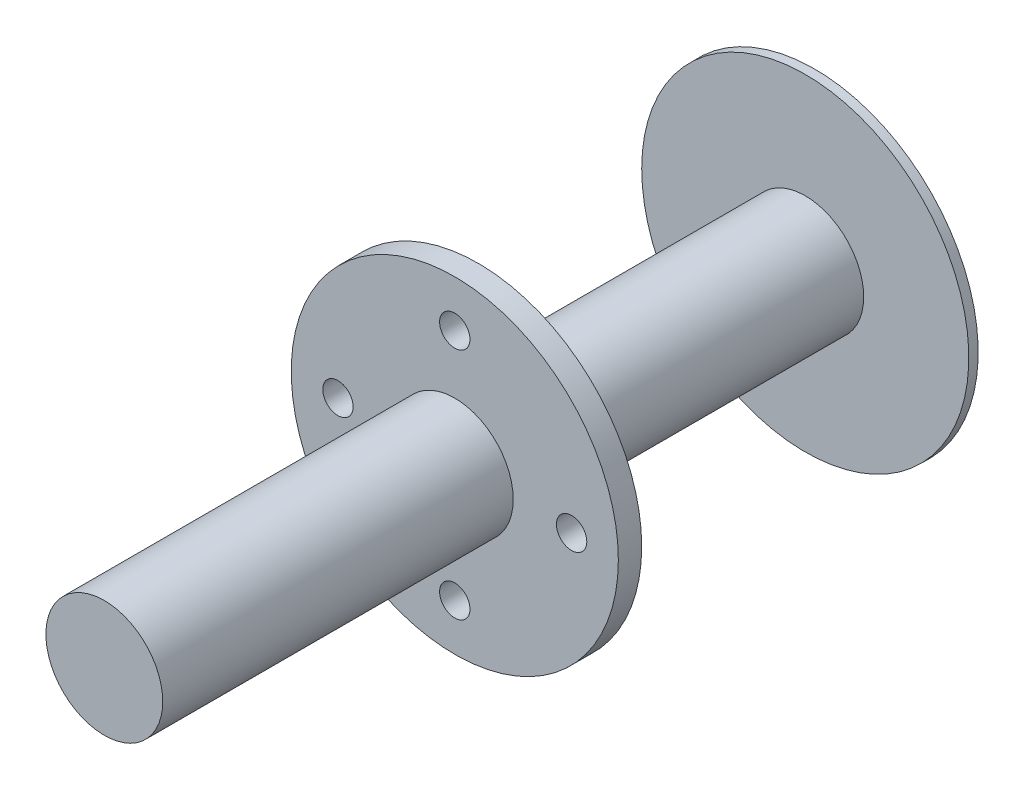
ISO-10303-21;
HEADER;
FILE_DESCRIPTION(('STEP AP214'),'2;1');
FILE_NAME('part.step','',(''),(''),'','','');
FILE_SCHEMA(('AUTOMOTIVE_DESIGN { 1 0 10303 214 1 1 1 1 }'));
ENDSEC;
DATA;
#1=APPLICATION_CONTEXT('core data for automotive mechanical design processes');
#2=APPLICATION_PROTOCOL_DEFINITION('international standard','automotive_design',2000,#1);
#3=PRODUCT_CONTEXT('',#1,'mechanical');
#4=PRODUCT('Part','Part','',(#3));
#5=PRODUCT_RELATED_PRODUCT_CATEGORY('part','',(#4));
#6=PRODUCT_DEFINITION_FORMATION('','',#4);
#7=PRODUCT_DEFINITION_CONTEXT('part definition',#1,'design');
#8=PRODUCT_DEFINITION('design','',#6,#7);
#9=PRODUCT_DEFINITION_SHAPE('','',#8);
#10=(LENGTH_UNIT() NAMED_UNIT(*) SI_UNIT(.MILLI.,.METRE.));
#11=(NAMED_UNIT(*) PLANE_ANGLE_UNIT() SI_UNIT($,.RADIAN.));
#12=(NAMED_UNIT(*) SI_UNIT($,.STERADIAN.) SOLID_ANGLE_UNIT());
#13=UNCERTAINTY_MEASURE_WITH_UNIT(LENGTH_MEASURE(1.E-05),#10,'distance_accuracy_value','');
#14=(GEOMETRIC_REPRESENTATION_CONTEXT(3) GLOBAL_UNCERTAINTY_ASSIGNED_CONTEXT((#13)) GLOBAL_UNIT_ASSIGNED_CONTEXT((#10,
#11,#12)) REPRESENTATION_CONTEXT('',''));
#15=CARTESIAN_POINT('',(0.,0.,0.));
#16=DIRECTION('',(0.,0.,1.));
#17=DIRECTION('',(1.,0.,0.));
#18=AXIS2_PLACEMENT_3D('',#15,#16,#17);
#19=CARTESIAN_POINT('',(0.,0.,10.));
#20=DIRECTION('',(0.,0.,1.));
#21=DIRECTION('',(1.,0.,0.));
#22=AXIS2_PLACEMENT_3D('',#19,#20,#21);
#23=PLANE('',#22);
#24=CARTESIAN_POINT('',(0.,0.,10.));
#25=DIRECTION('',(0.,0.,1.));
#26=DIRECTION('',(1.,0.,0.));
#27=AXIS2_PLACEMENT_3D('',#24,#25,#26);
#28=CIRCLE('',#27,25.);
#29=CARTESIAN_POINT('',(25.,0.,10.));
#30=VERTEX_POINT('',#29);
#31=EDGE_CURVE('E10',#30,#30,#28,.T.);
#32=ORIENTED_EDGE('',*,*,#31,.F.);
#33=EDGE_LOOP('',(#32));
#34=FACE_BOUND('',#33,.T.);
#35=CARTESIAN_POINT('',(0.,-50.,10.));
#36=DIRECTION('',(0.,0.,1.));
#37=DIRECTION('',(1.,0.,0.));
#38=AXIS2_PLACEMENT_3D('',#35,#36,#37);
#39=CIRCLE('',#38,6.5);
#40=CARTESIAN_POINT('',(6.50000000000001,-50.,10.));
#41=VERTEX_POINT('',#40);
#42=EDGE_CURVE('E69',#41,#41,#39,.T.);
#43=ORIENTED_EDGE('',*,*,#42,.F.);
#44=EDGE_LOOP('',(#43));
#45=FACE_BOUND('',#44,.T.);
#46=CARTESIAN_POINT('',(0.,50.,10.));
#47=DIRECTION('',(0.,0.,1.));
#48=DIRECTION('',(1.,0.,0.));
#49=AXIS2_PLACEMENT_3D('',#46,#47,#48);
#50=CIRCLE('',#49,6.5);
#51=CARTESIAN_POINT('',(6.5,50.,10.));
#52=VERTEX_POINT('',#51);
#53=EDGE_CURVE('E85',#52,#52,#50,.T.);
#54=ORIENTED_EDGE('',*,*,#53,.F.);
#55=EDGE_LOOP('',(#54));
#56=FACE_BOUND('',#55,.T.);
#57=CARTESIAN_POINT('',(0.,0.,10.));
#58=DIRECTION('',(0.,0.,1.));
#59=DIRECTION('',(1.,0.,0.));
#60=AXIS2_PLACEMENT_3D('',#57,#58,#59);
#61=CIRCLE('',#60,70.);
#62=CARTESIAN_POINT('',(70.,0.,10.));
#63=VERTEX_POINT('',#62);
#64=EDGE_CURVE('E48',#63,#63,#61,.T.);
#65=ORIENTED_EDGE('',*,*,#64,.T.);
#66=EDGE_LOOP('',(#65));
#67=FACE_BOUND('',#66,.T.);
#68=CARTESIAN_POINT('',(50.,0.,10.));
#69=DIRECTION('',(0.,0.,1.));
#70=DIRECTION('',(1.,0.,0.));
#71=AXIS2_PLACEMENT_3D('',#68,#69,#70);
#72=CIRCLE('',#71,6.49999999999999);
#73=CARTESIAN_POINT('',(56.5,0.,10.));
#74=VERTEX_POINT('',#73);
#75=EDGE_CURVE('E77',#74,#74,#72,.T.);
#76=ORIENTED_EDGE('',*,*,#75,.F.);
#77=EDGE_LOOP('',(#76));
#78=FACE_BOUND('',#77,.T.);
#79=CARTESIAN_POINT('',(-50.,0.,10.));
#80=DIRECTION('',(0.,0.,1.));
#81=DIRECTION('',(1.,0.,0.));
#82=AXIS2_PLACEMENT_3D('',#79,#80,#81);
#83=CIRCLE('',#82,6.5);
#84=CARTESIAN_POINT('',(-43.5,0.,10.));
#85=VERTEX_POINT('',#84);
#86=EDGE_CURVE('E60',#85,#85,#83,.T.);
#87=ORIENTED_EDGE('',*,*,#86,.F.);
#88=EDGE_LOOP('',(#87));
#89=FACE_BOUND('',#88,.T.);
#90=ADVANCED_FACE('F39',(#34,#45,#56,#67,#78,#89),#23,.T.);
#91=CARTESIAN_POINT('',(0.,0.,0.));
#92=DIRECTION('',(0.,0.,1.));
#93=DIRECTION('',(1.,0.,0.));
#94=AXIS2_PLACEMENT_3D('',#91,#92,#93);
#95=PLANE('',#94);
#96=CARTESIAN_POINT('',(0.,0.,0.));
#97=DIRECTION('',(0.,0.,1.));
#98=DIRECTION('',(1.,0.,0.));
#99=AXIS2_PLACEMENT_3D('',#96,#97,#98);
#100=CIRCLE('',#99,25.);
#101=CARTESIAN_POINT('',(25.,0.,0.));
#102=VERTEX_POINT('',#101);
#103=EDGE_CURVE('E43',#102,#102,#100,.T.);
#104=ORIENTED_EDGE('',*,*,#103,.T.);
#105=EDGE_LOOP('',(#104));
#106=FACE_BOUND('',#105,.T.);
#107=CARTESIAN_POINT('',(0.,0.,0.));
#108=DIRECTION('',(0.,0.,1.));
#109=DIRECTION('',(1.,0.,0.));
#110=AXIS2_PLACEMENT_3D('',#107,#108,#109);
#111=CIRCLE('',#110,70.);
#112=CARTESIAN_POINT('',(70.,0.,0.));
#113=VERTEX_POINT('',#112);
#114=EDGE_CURVE('E54',#113,#113,#111,.T.);
#115=ORIENTED_EDGE('',*,*,#114,.F.);
#116=EDGE_LOOP('',(#115));
#117=FACE_BOUND('',#116,.T.);
#118=CARTESIAN_POINT('',(0.,50.,0.));
#119=DIRECTION('',(0.,0.,1.));
#120=DIRECTION('',(1.,0.,0.));
#121=AXIS2_PLACEMENT_3D('',#118,#119,#120);
#122=CIRCLE('',#121,6.5);
#123=CARTESIAN_POINT('',(6.5,50.,0.));
#124=VERTEX_POINT('',#123);
#125=EDGE_CURVE('E81',#124,#124,#122,.T.);
#126=ORIENTED_EDGE('',*,*,#125,.T.);
#127=EDGE_LOOP('',(#126));
#128=FACE_BOUND('',#127,.T.);
#129=CARTESIAN_POINT('',(50.,0.,0.));
#130=DIRECTION('',(0.,0.,1.));
#131=DIRECTION('',(1.,0.,0.));
#132=AXIS2_PLACEMENT_3D('',#129,#130,#131);
#133=CIRCLE('',#132,6.49999999999999);
#134=CARTESIAN_POINT('',(56.5,0.,0.));
#135=VERTEX_POINT('',#134);
#136=EDGE_CURVE('E73',#135,#135,#133,.T.);
#137=ORIENTED_EDGE('',*,*,#136,.T.);
#138=EDGE_LOOP('',(#137));
#139=FACE_BOUND('',#138,.T.);
#140=CARTESIAN_POINT('',(0.,-50.,0.));
#141=DIRECTION('',(0.,0.,1.));
#142=DIRECTION('',(1.,0.,0.));
#143=AXIS2_PLACEMENT_3D('',#140,#141,#142);
#144=CIRCLE('',#143,6.5);
#145=CARTESIAN_POINT('',(6.50000000000001,-50.,0.));
#146=VERTEX_POINT('',#145);
#147=EDGE_CURVE('E64',#146,#146,#144,.T.);
#148=ORIENTED_EDGE('',*,*,#147,.T.);
#149=EDGE_LOOP('',(#148));
#150=FACE_BOUND('',#149,.T.);
#151=CARTESIAN_POINT('',(-50.,0.,0.));
#152=DIRECTION('',(0.,0.,1.));
#153=DIRECTION('',(1.,0.,0.));
#154=AXIS2_PLACEMENT_3D('',#151,#152,#153);
#155=CIRCLE('',#154,6.5);
#156=CARTESIAN_POINT('',(-43.5,0.,0.));
#157=VERTEX_POINT('',#156);
#158=EDGE_CURVE('E65',#157,#157,#155,.T.);
#159=ORIENTED_EDGE('',*,*,#158,.T.);
#160=EDGE_LOOP('',(#159));
#161=FACE_BOUND('',#160,.T.);
#162=ADVANCED_FACE('F96',(#106,#117,#128,#139,#150,#161),#95,.F.);
#163=CARTESIAN_POINT('',(0.,0.,10.));
#164=DIRECTION('',(0.,0.,-1.));
#165=DIRECTION('',(-1.,0.,0.));
#166=AXIS2_PLACEMENT_3D('',#163,#164,#165);
#167=CYLINDRICAL_SURFACE('',#166,70.);
#168=ORIENTED_EDGE('',*,*,#64,.F.);
#169=EDGE_LOOP('',(#168));
#170=FACE_BOUND('',#169,.T.);
#171=ORIENTED_EDGE('',*,*,#114,.T.);
#172=EDGE_LOOP('',(#171));
#173=FACE_BOUND('',#172,.T.);
#174=ADVANCED_FACE('F41',(#170,#173),#167,.T.);
#175=CARTESIAN_POINT('',(0.,50.,10.));
#176=DIRECTION('',(0.,0.,-1.));
#177=DIRECTION('',(-1.,0.,0.));
#178=AXIS2_PLACEMENT_3D('',#175,#176,#177);
#179=CYLINDRICAL_SURFACE('',#178,6.5);
#180=ORIENTED_EDGE('',*,*,#53,.T.);
#181=EDGE_LOOP('',(#180));
#182=FACE_BOUND('',#181,.T.);
#183=ORIENTED_EDGE('',*,*,#125,.F.);
#184=EDGE_LOOP('',(#183));
#185=FACE_BOUND('',#184,.T.);
#186=ADVANCED_FACE('F131',(#182,#185),#179,.F.);
#187=CARTESIAN_POINT('',(50.,0.,10.));
#188=DIRECTION('',(0.,0.,-1.));
#189=DIRECTION('',(-1.,0.,0.));
#190=AXIS2_PLACEMENT_3D('',#187,#188,#189);
#191=CYLINDRICAL_SURFACE('',#190,6.49999999999999);
#192=ORIENTED_EDGE('',*,*,#75,.T.);
#193=EDGE_LOOP('',(#192));
#194=FACE_BOUND('',#193,.T.);
#195=ORIENTED_EDGE('',*,*,#136,.F.);
#196=EDGE_LOOP('',(#195));
#197=FACE_BOUND('',#196,.T.);
#198=ADVANCED_FACE('F121',(#194,#197),#191,.F.);
#199=CARTESIAN_POINT('',(0.,-50.,10.));
#200=DIRECTION('',(0.,0.,-1.));
#201=DIRECTION('',(-1.,0.,0.));
#202=AXIS2_PLACEMENT_3D('',#199,#200,#201);
#203=CYLINDRICAL_SURFACE('',#202,6.5);
#204=ORIENTED_EDGE('',*,*,#42,.T.);
#205=EDGE_LOOP('',(#204));
#206=FACE_BOUND('',#205,.T.);
#207=ORIENTED_EDGE('',*,*,#147,.F.);
#208=EDGE_LOOP('',(#207));
#209=FACE_BOUND('',#208,.T.);
#210=ADVANCED_FACE('F111',(#206,#209),#203,.F.);
#211=CARTESIAN_POINT('',(-50.,0.,10.));
#212=DIRECTION('',(0.,0.,-1.));
#213=DIRECTION('',(-1.,0.,0.));
#214=AXIS2_PLACEMENT_3D('',#211,#212,#213);
#215=CYLINDRICAL_SURFACE('',#214,6.5);
#216=ORIENTED_EDGE('',*,*,#86,.T.);
#217=EDGE_LOOP('',(#216));
#218=FACE_BOUND('',#217,.T.);
#219=ORIENTED_EDGE('',*,*,#158,.F.);
#220=EDGE_LOOP('',(#219));
#221=FACE_BOUND('',#220,.T.);
#222=ADVANCED_FACE('F108',(#218,#221),#215,.F.);
#223=CARTESIAN_POINT('',(0.,0.,-140.));
#224=DIRECTION('',(0.,0.,1.));
#225=DIRECTION('',(1.,0.,0.));
#226=AXIS2_PLACEMENT_3D('',#223,#224,#225);
#227=CYLINDRICAL_SURFACE('',#226,25.);
#228=CARTESIAN_POINT('',(0.,0.,-140.));
#229=DIRECTION('',(0.,0.,1.));
#230=DIRECTION('',(1.,0.,0.));
#231=AXIS2_PLACEMENT_3D('',#228,#229,#230);
#232=CIRCLE('',#231,25.);
#233=CARTESIAN_POINT('',(25.,0.,-140.));
#234=VERTEX_POINT('',#233);
#235=EDGE_CURVE('E58',#234,#234,#232,.T.);
#236=ORIENTED_EDGE('',*,*,#235,.T.);
#237=EDGE_LOOP('',(#236));
#238=FACE_BOUND('',#237,.T.);
#239=ORIENTED_EDGE('',*,*,#103,.F.);
#240=EDGE_LOOP('',(#239));
#241=FACE_BOUND('',#240,.T.);
#242=ADVANCED_FACE('F110',(#238,#241),#227,.T.);
#243=ORIENTED_EDGE('',*,*,#31,.T.);
#244=EDGE_LOOP('',(#243));
#245=FACE_BOUND('',#244,.T.);
#246=CARTESIAN_POINT('',(0.,0.,160.));
#247=DIRECTION('',(0.,0.,1.));
#248=DIRECTION('',(1.,0.,0.));
#249=AXIS2_PLACEMENT_3D('',#246,#247,#248);
#250=CIRCLE('',#249,25.);
#251=CARTESIAN_POINT('',(25.,0.,160.));
#252=VERTEX_POINT('',#251);
#253=EDGE_CURVE('E236',#252,#252,#250,.T.);
#254=ORIENTED_EDGE('',*,*,#253,.F.);
#255=EDGE_LOOP('',(#254));
#256=FACE_BOUND('',#255,.T.);
#257=ADVANCED_FACE('F118',(#245,#256),#227,.T.);
#258=CARTESIAN_POINT('',(0.,0.,160.));
#259=DIRECTION('',(0.,0.,1.));
#260=DIRECTION('',(1.,0.,0.));
#261=AXIS2_PLACEMENT_3D('',#258,#259,#260);
#262=PLANE('',#261);
#263=ORIENTED_EDGE('',*,*,#253,.T.);
#264=EDGE_LOOP('',(#263));
#265=FACE_BOUND('',#264,.T.);
#266=ADVANCED_FACE('F181',(#265),#262,.T.);
#267=CARTESIAN_POINT('',(0.,0.,-144.));
#268=DIRECTION('',(0.,0.,1.));
#269=DIRECTION('',(1.,0.,0.));
#270=AXIS2_PLACEMENT_3D('',#267,#268,#269);
#271=CYLINDRICAL_SURFACE('',#270,70.);
#272=CARTESIAN_POINT('',(0.,0.,-144.));
#273=DIRECTION('',(0.,0.,-1.));
#274=DIRECTION('',(-1.,0.,0.));
#275=AXIS2_PLACEMENT_3D('',#272,#273,#274);
#276=CIRCLE('',#275,70.);
#277=CARTESIAN_POINT('',(-70.,0.,-144.));
#278=VERTEX_POINT('',#277);
#279=EDGE_CURVE('E231',#278,#278,#276,.T.);
#280=ORIENTED_EDGE('',*,*,#279,.F.);
#281=EDGE_LOOP('',(#280));
#282=FACE_BOUND('',#281,.T.);
#283=CARTESIAN_POINT('',(0.,0.,-140.));
#284=DIRECTION('',(0.,0.,-1.));
#285=DIRECTION('',(-1.,0.,0.));
#286=AXIS2_PLACEMENT_3D('',#283,#284,#285);
#287=CIRCLE('',#286,70.);
#288=CARTESIAN_POINT('',(-70.,0.,-140.));
#289=VERTEX_POINT('',#288);
#290=EDGE_CURVE('E228',#289,#289,#287,.T.);
#291=ORIENTED_EDGE('',*,*,#290,.T.);
#292=EDGE_LOOP('',(#291));
#293=FACE_BOUND('',#292,.T.);
#294=ADVANCED_FACE('F189',(#282,#293),#271,.T.);
#295=CARTESIAN_POINT('',(0.,0.,-144.));
#296=DIRECTION('',(0.,0.,-1.));
#297=DIRECTION('',(-1.,0.,0.));
#298=AXIS2_PLACEMENT_3D('',#295,#296,#297);
#299=PLANE('',#298);
#300=ORIENTED_EDGE('',*,*,#279,.T.);
#301=EDGE_LOOP('',(#300));
#302=FACE_BOUND('',#301,.T.);
#303=ADVANCED_FACE('F199',(#302),#299,.T.);
#304=CARTESIAN_POINT('',(0.,0.,-140.));
#305=DIRECTION('',(0.,0.,-1.));
#306=DIRECTION('',(-1.,0.,0.));
#307=AXIS2_PLACEMENT_3D('',#304,#305,#306);
#308=PLANE('',#307);
#309=ORIENTED_EDGE('',*,*,#235,.F.);
#310=EDGE_LOOP('',(#309));
#311=FACE_BOUND('',#310,.T.);
#312=ORIENTED_EDGE('',*,*,#290,.F.);
#313=EDGE_LOOP('',(#312));
#314=FACE_BOUND('',#313,.T.);
#315=ADVANCED_FACE('F209',(#311,#314),#308,.F.);
#316=CLOSED_SHELL('',(#90,#162,#174,#186,#198,#210,#222,#242,#257,#266,#294,#303,#315));
#317=MANIFOLD_SOLID_BREP('B2',#316);
#318=ADVANCED_BREP_SHAPE_REPRESENTATION('',(#18,#317),#14);
#319=SHAPE_DEFINITION_REPRESENTATION(#9,#318);
ENDSEC;
END-ISO-10303-21;
